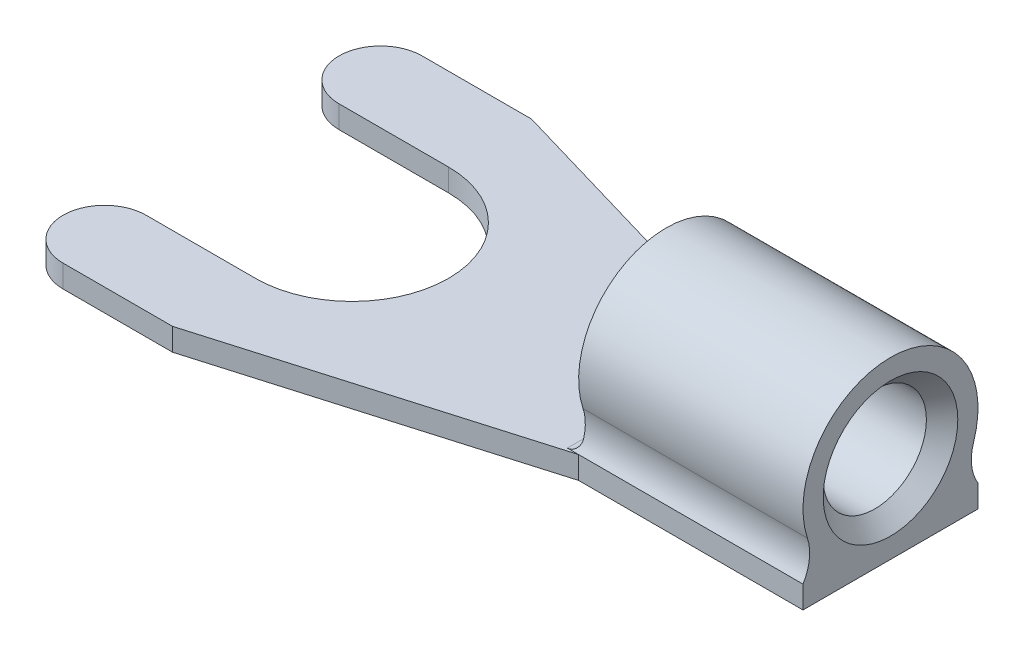
ISO-10303-21;
HEADER;
FILE_DESCRIPTION(('STEP AP214'),'2;1');
FILE_NAME('part.step','',(''),(''),'','','');
FILE_SCHEMA(('AUTOMOTIVE_DESIGN { 1 0 10303 214 1 1 1 1 }'));
ENDSEC;
DATA;
#1=APPLICATION_CONTEXT('core data for automotive mechanical design processes');
#2=APPLICATION_PROTOCOL_DEFINITION('international standard','automotive_design',2000,#1);
#3=PRODUCT_CONTEXT('',#1,'mechanical');
#4=PRODUCT('Part','Part','',(#3));
#5=PRODUCT_RELATED_PRODUCT_CATEGORY('part','',(#4));
#6=PRODUCT_DEFINITION_FORMATION('','',#4);
#7=PRODUCT_DEFINITION_CONTEXT('part definition',#1,'design');
#8=PRODUCT_DEFINITION('design','',#6,#7);
#9=PRODUCT_DEFINITION_SHAPE('','',#8);
#10=(LENGTH_UNIT() NAMED_UNIT(*) SI_UNIT(.MILLI.,.METRE.));
#11=(NAMED_UNIT(*) PLANE_ANGLE_UNIT() SI_UNIT($,.RADIAN.));
#12=(NAMED_UNIT(*) SI_UNIT($,.STERADIAN.) SOLID_ANGLE_UNIT());
#13=UNCERTAINTY_MEASURE_WITH_UNIT(LENGTH_MEASURE(1.E-05),#10,'distance_accuracy_value','');
#14=(GEOMETRIC_REPRESENTATION_CONTEXT(3) GLOBAL_UNCERTAINTY_ASSIGNED_CONTEXT((#13)) GLOBAL_UNIT_ASSIGNED_CONTEXT((#10,
#11,#12)) REPRESENTATION_CONTEXT('',''));
#15=CARTESIAN_POINT('',(0.,0.,0.));
#16=DIRECTION('',(0.,0.,1.));
#17=DIRECTION('',(1.,0.,0.));
#18=AXIS2_PLACEMENT_3D('',#15,#16,#17);
#19=CARTESIAN_POINT('',(6.75,0.75,0.));
#20=DIRECTION('',(0.,0.,-1.));
#21=DIRECTION('',(-1.,0.,0.));
#22=AXIS2_PLACEMENT_3D('',#19,#20,#21);
#23=CYLINDRICAL_SURFACE('',#22,0.25);
#24=DIRECTION('',(0.,0.,-1.));
#25=VECTOR('',#24,1.);
#26=CARTESIAN_POINT('',(7.,0.75,0.));
#27=LINE('',#26,#25);
#28=CARTESIAN_POINT('',(7.,0.75,1.83970172769144));
#29=VERTEX_POINT('',#28);
#30=CARTESIAN_POINT('',(7.,0.75,-1.83970172769145));
#31=VERTEX_POINT('',#30);
#32=EDGE_CURVE('E136',#29,#31,#27,.T.);
#33=ORIENTED_EDGE('',*,*,#32,.T.);
#34=CARTESIAN_POINT('',(6.75,0.5,-1.95));
#35=CARTESIAN_POINT('',(6.76279265219974,0.49998350208187,-1.95001852201698));
#36=CARTESIAN_POINT('',(6.7755633057261,0.500980599796446,-1.94939519772531));
#37=CARTESIAN_POINT('',(6.80063546863913,0.504859731445587,-1.94701727306771));
#38=CARTESIAN_POINT('',(6.81293922839229,0.507731040580708,-1.94526911017123));
#39=CARTESIAN_POINT('',(6.83678560324556,0.515212911902467,-1.94079455531296));
#40=CARTESIAN_POINT('',(6.84832945788207,0.519820554876355,-1.93806980561242));
#41=CARTESIAN_POINT('',(6.870457868658,0.530588402063698,-1.9318583154222));
#42=CARTESIAN_POINT('',(6.88104113706603,0.536750649720279,-1.92837057282786));
#43=CARTESIAN_POINT('',(6.90182686819083,0.550955109626043,-1.92057204094232));
#44=CARTESIAN_POINT('',(6.91194019338923,0.559104161345929,-1.91621898373589));
#45=CARTESIAN_POINT('',(6.93070840237227,0.576764076820902,-1.90714700315842));
#46=CARTESIAN_POINT('',(6.93936258007138,0.586275595783677,-1.90242790426221));
#47=CARTESIAN_POINT('',(6.95610042568564,0.607764133345738,-1.89223760604453));
#48=CARTESIAN_POINT('',(6.96396839551215,0.619900907889746,-1.88674760040437));
#49=CARTESIAN_POINT('',(6.97751486064914,0.645381102194384,-1.87588282433389));
#50=CARTESIAN_POINT('',(6.98319426201095,0.65872401979007,-1.87050800708861));
#51=CARTESIAN_POINT('',(6.99171759524682,0.684875563743601,-1.86066348131627));
#52=CARTESIAN_POINT('',(6.99479581212117,0.697594317014776,-1.85615788313342));
#53=CARTESIAN_POINT('',(6.99894022470101,0.723508733763793,-1.84757298169228));
#54=CARTESIAN_POINT('',(7.00000420944867,0.736704905121006,-1.84349415151592));
#55=CARTESIAN_POINT('',(7.,0.75,-1.83970172769145));
#56=B_SPLINE_CURVE_WITH_KNOTS('',3,(#34,#35,#36,#37,#38,#39,#40,#41,#42,#43,#44,#45,#46,#47,#48,
#49,#50,#51,#52,#53,#54,#55),.UNSPECIFIED.,.F.,.F.,(4,2,2,2,2,2,2,2,2,2,4),(0.,
0.0382893069018886,0.0763614093332972,0.114369786533511,0.152428386377301,0.193361552979276,
0.234314470757137,0.280522325949254,0.326711030823096,0.368073046255097,0.409480437175454),.UNSPECIFIED.);
#57=CARTESIAN_POINT('',(6.75,0.5,-1.95));
#58=VERTEX_POINT('',#57);
#59=EDGE_CURVE('E20',#58,#31,#56,.T.);
#60=ORIENTED_EDGE('',*,*,#59,.F.);
#61=DIRECTION('',(0.,0.,1.));
#62=VECTOR('',#61,1.);
#63=CARTESIAN_POINT('',(6.75,0.5,0.));
#64=LINE('',#63,#62);
#65=CARTESIAN_POINT('',(6.75,0.5,1.95));
#66=VERTEX_POINT('',#65);
#67=EDGE_CURVE('E133',#66,#58,#64,.F.);
#68=ORIENTED_EDGE('',*,*,#67,.F.);
#69=CARTESIAN_POINT('',(7.,0.75,1.83970172769144));
#70=CARTESIAN_POINT('',(7.000006521075,0.735127796790294,1.84394032011878));
#71=CARTESIAN_POINT('',(6.99867427441531,0.720382659943751,1.84854137054598));
#72=CARTESIAN_POINT('',(6.99350891013348,0.691550767285415,1.8582501300237));
#73=CARTESIAN_POINT('',(6.98968232860374,0.677462393603863,1.86335648540662));
#74=CARTESIAN_POINT('',(6.97970942661208,0.650283784135015,1.87387530595083));
#75=CARTESIAN_POINT('',(6.97356600432858,0.637192325778406,1.87928738151938));
#76=CARTESIAN_POINT('',(6.95913179602968,0.612263039792255,1.89017218669945));
#77=CARTESIAN_POINT('',(6.95083905655132,0.600426366468528,1.8956449671302));
#78=CARTESIAN_POINT('',(6.93190778527895,0.577851412965472,1.9065665800011));
#79=CARTESIAN_POINT('',(6.92118933448232,0.567175227082837,1.9120058737872));
#80=CARTESIAN_POINT('',(6.89781213081132,0.547807805392044,1.92224466813309));
#81=CARTESIAN_POINT('',(6.88515348283173,0.539116462338589,1.92704420325457));
#82=CARTESIAN_POINT('',(6.85882494158289,0.524449038300311,1.93536105133942));
#83=CARTESIAN_POINT('',(6.84523320827134,0.518362266308088,1.93892902019162));
#84=CARTESIAN_POINT('',(6.81693782547046,0.508667793434214,1.9446966990955));
#85=CARTESIAN_POINT('',(6.80223768054368,0.505052615028265,1.94690053424634));
#86=CARTESIAN_POINT('',(6.78112626789295,0.501866510936535,1.94885133002611));
#87=CARTESIAN_POINT('',(6.7749289859734,0.501167615441771,1.94928088909551));
#88=CARTESIAN_POINT('',(6.76248923138757,0.500234473310872,1.94985533198226));
#89=CARTESIAN_POINT('',(6.75624677974096,0.500000022951555,1.95000034061393));
#90=CARTESIAN_POINT('',(6.75,0.5,1.95));
#91=B_SPLINE_CURVE_WITH_KNOTS('',3,(#69,#70,#71,#72,#73,#74,#75,#76,#77,#78,#79,#80,#81,#82,#83,
#84,#85,#86,#87,#88,#89,#90),.UNSPECIFIED.,.F.,.F.,(4,2,2,2,2,2,2,2,2,2,4),(0.,
0.0462989373863092,0.0924770392758406,0.138597566715203,0.18476015989697,0.232751610935631,
0.280740468279867,0.326416072227268,0.371952870974995,0.390686940772955,0.409412791278968),.UNSPECIFIED.);
#92=EDGE_CURVE('E141',#29,#66,#91,.T.);
#93=ORIENTED_EDGE('',*,*,#92,.F.);
#94=EDGE_LOOP('',(#33,#60,#68,#93));
#95=FACE_BOUND('',#94,.T.);
#96=ADVANCED_FACE('F16',(#95),#23,.F.);
#97=CARTESIAN_POINT('',(7.,1.95,0.));
#98=DIRECTION('',(1.,0.,0.));
#99=DIRECTION('',(0.,0.,-1.));
#100=AXIS2_PLACEMENT_3D('',#97,#98,#99);
#101=CYLINDRICAL_SURFACE('',#100,1.15);
#102=CARTESIAN_POINT('',(11.6499999999746,1.95,0.));
#103=DIRECTION('',(1.,0.,0.));
#104=DIRECTION('',(0.,0.,-1.));
#105=AXIS2_PLACEMENT_3D('',#102,#103,#104);
#106=CIRCLE('',#105,1.14999999999554);
#107=CARTESIAN_POINT('',(11.6499999999746,1.95,-1.14999999999554));
#108=VERTEX_POINT('',#107);
#109=EDGE_CURVE('E225',#108,#108,#106,.T.);
#110=ORIENTED_EDGE('',*,*,#109,.T.);
#111=EDGE_LOOP('',(#110));
#112=FACE_BOUND('',#111,.T.);
#113=CARTESIAN_POINT('',(7.,1.95,0.));
#114=DIRECTION('',(1.,0.,0.));
#115=DIRECTION('',(0.,0.,-1.));
#116=AXIS2_PLACEMENT_3D('',#113,#114,#115);
#117=CIRCLE('',#116,1.15);
#118=CARTESIAN_POINT('',(7.,1.95,-1.15));
#119=VERTEX_POINT('',#118);
#120=EDGE_CURVE('E151',#119,#119,#117,.F.);
#121=ORIENTED_EDGE('',*,*,#120,.T.);
#122=EDGE_LOOP('',(#121));
#123=FACE_BOUND('',#122,.T.);
#124=ADVANCED_FACE('F279',(#112,#123),#101,.F.);
#125=CARTESIAN_POINT('',(7.,1.95,0.));
#126=DIRECTION('',(1.,0.,0.));
#127=DIRECTION('',(0.,0.,-1.));
#128=AXIS2_PLACEMENT_3D('',#125,#126,#127);
#129=PLANE('',#128);
#130=ORIENTED_EDGE('',*,*,#120,.F.);
#131=EDGE_LOOP('',(#130));
#132=FACE_BOUND('',#131,.T.);
#133=ORIENTED_EDGE('',*,*,#32,.F.);
#134=CARTESIAN_POINT('',(7.,1.02486780796408,2.80118375463996));
#135=DIRECTION('',(-1.,0.,0.));
#136=DIRECTION('',(0.,0.,1.));
#137=AXIS2_PLACEMENT_3D('',#134,#135,#136);
#138=CIRCLE('',#137,1.);
#139=CARTESIAN_POINT('',(7.,1.33847194085761,1.85162993950777));
#140=VERTEX_POINT('',#139);
#141=EDGE_CURVE('E192',#29,#140,#138,.F.);
#142=ORIENTED_EDGE('',*,*,#141,.T.);
#143=CARTESIAN_POINT('',(7.,1.95,0.));
#144=DIRECTION('',(1.,0.,0.));
#145=DIRECTION('',(0.,0.,-1.));
#146=AXIS2_PLACEMENT_3D('',#143,#144,#145);
#147=CIRCLE('',#146,1.95);
#148=CARTESIAN_POINT('',(7.,1.33847194085761,-1.85162993950777));
#149=VERTEX_POINT('',#148);
#150=EDGE_CURVE('E162',#149,#140,#147,.T.);
#151=ORIENTED_EDGE('',*,*,#150,.F.);
#152=CARTESIAN_POINT('',(7.,1.02486780796408,-2.80118375463996));
#153=DIRECTION('',(1.,0.,0.));
#154=DIRECTION('',(0.,0.,-1.));
#155=AXIS2_PLACEMENT_3D('',#152,#153,#154);
#156=CIRCLE('',#155,1.);
#157=EDGE_CURVE('E224',#31,#149,#156,.F.);
#158=ORIENTED_EDGE('',*,*,#157,.F.);
#159=EDGE_LOOP('',(#133,#142,#151,#158));
#160=FACE_BOUND('',#159,.T.);
#161=ADVANCED_FACE('F277',(#132,#160),#129,.F.);
#162=CARTESIAN_POINT('',(0.,0.5,0.));
#163=DIRECTION('',(0.,1.,0.));
#164=DIRECTION('',(0.,0.,1.));
#165=AXIS2_PLACEMENT_3D('',#162,#163,#164);
#166=PLANE('',#165);
#167=DIRECTION('',(-0.959692321040619,0.,0.281052751161895));
#168=VECTOR('',#167,1.);
#169=CARTESIAN_POINT('',(1.07889666838964,0.5,3.68403740425732));
#170=LINE('',#169,#168);
#171=CARTESIAN_POINT('',(0.,0.5,4.));
#172=VERTEX_POINT('',#171);
#173=CARTESIAN_POINT('',(7.,0.5,1.95));
#174=VERTEX_POINT('',#173);
#175=EDGE_CURVE('E198',#172,#174,#170,.F.);
#176=ORIENTED_EDGE('',*,*,#175,.T.);
#177=DIRECTION('',(-1.,0.,0.));
#178=VECTOR('',#177,1.);
#179=CARTESIAN_POINT('',(0.,0.499999999999999,1.95));
#180=LINE('',#179,#178);
#181=EDGE_CURVE('E149',#174,#66,#180,.T.);
#182=ORIENTED_EDGE('',*,*,#181,.T.);
#183=ORIENTED_EDGE('',*,*,#67,.T.);
#184=DIRECTION('',(1.,0.,0.));
#185=VECTOR('',#184,1.);
#186=CARTESIAN_POINT('',(0.,0.5,-1.95));
#187=LINE('',#186,#185);
#188=CARTESIAN_POINT('',(7.,0.5,-1.95));
#189=VERTEX_POINT('',#188);
#190=EDGE_CURVE('E147',#58,#189,#187,.T.);
#191=ORIENTED_EDGE('',*,*,#190,.T.);
#192=DIRECTION('',(0.959692321040619,0.,0.281052751161895));
#193=VECTOR('',#192,1.);
#194=CARTESIAN_POINT('',(1.07889666838964,0.5,-3.68403740425732));
#195=LINE('',#194,#193);
#196=CARTESIAN_POINT('',(0.,0.5,-4.));
#197=VERTEX_POINT('',#196);
#198=EDGE_CURVE('E156',#189,#197,#195,.F.);
#199=ORIENTED_EDGE('',*,*,#198,.T.);
#200=DIRECTION('',(-1.,0.,0.));
#201=VECTOR('',#200,1.);
#202=CARTESIAN_POINT('',(0.,0.5,-4.));
#203=LINE('',#202,#201);
#204=CARTESIAN_POINT('',(-2.43926218353009,0.5,-4.));
#205=VERTEX_POINT('',#204);
#206=EDGE_CURVE('E159',#205,#197,#203,.F.);
#207=ORIENTED_EDGE('',*,*,#206,.F.);
#208=CARTESIAN_POINT('',(-2.43926218353009,0.5,-3.075));
#209=DIRECTION('',(0.,-1.,0.));
#210=DIRECTION('',(0.,0.,-1.));
#211=AXIS2_PLACEMENT_3D('',#208,#209,#210);
#212=CIRCLE('',#211,0.925);
#213=CARTESIAN_POINT('',(-2.43926218353009,0.5,-2.15));
#214=VERTEX_POINT('',#213);
#215=EDGE_CURVE('E254',#214,#205,#212,.T.);
#216=ORIENTED_EDGE('',*,*,#215,.F.);
#217=DIRECTION('',(1.,0.,0.));
#218=VECTOR('',#217,1.);
#219=CARTESIAN_POINT('',(0.,0.5,-2.15));
#220=LINE('',#219,#218);
#221=CARTESIAN_POINT('',(0.,0.5,-2.15));
#222=VERTEX_POINT('',#221);
#223=EDGE_CURVE('E215',#222,#214,#220,.F.);
#224=ORIENTED_EDGE('',*,*,#223,.F.);
#225=CARTESIAN_POINT('',(0.,0.5,0.));
#226=DIRECTION('',(0.,-1.,0.));
#227=DIRECTION('',(0.,0.,-1.));
#228=AXIS2_PLACEMENT_3D('',#225,#226,#227);
#229=CIRCLE('',#228,2.15);
#230=CARTESIAN_POINT('',(0.,0.5,2.15));
#231=VERTEX_POINT('',#230);
#232=EDGE_CURVE('E251',#222,#231,#229,.T.);
#233=ORIENTED_EDGE('',*,*,#232,.T.);
#234=DIRECTION('',(1.,0.,0.));
#235=VECTOR('',#234,1.);
#236=CARTESIAN_POINT('',(0.,0.5,2.15));
#237=LINE('',#236,#235);
#238=CARTESIAN_POINT('',(-2.43926218353009,0.5,2.15));
#239=VERTEX_POINT('',#238);
#240=EDGE_CURVE('E210',#231,#239,#237,.F.);
#241=ORIENTED_EDGE('',*,*,#240,.T.);
#242=CARTESIAN_POINT('',(-2.43926218353009,0.5,3.075));
#243=DIRECTION('',(0.,-1.,0.));
#244=DIRECTION('',(0.,0.,-1.));
#245=AXIS2_PLACEMENT_3D('',#242,#243,#244);
#246=CIRCLE('',#245,0.925);
#247=CARTESIAN_POINT('',(-2.43926218353009,0.5,4.));
#248=VERTEX_POINT('',#247);
#249=EDGE_CURVE('E213',#248,#239,#246,.T.);
#250=ORIENTED_EDGE('',*,*,#249,.F.);
#251=DIRECTION('',(-1.,0.,0.));
#252=VECTOR('',#251,1.);
#253=CARTESIAN_POINT('',(0.,0.5,4.));
#254=LINE('',#253,#252);
#255=EDGE_CURVE('E205',#248,#172,#254,.F.);
#256=ORIENTED_EDGE('',*,*,#255,.T.);
#257=EDGE_LOOP('',(#176,#182,#183,#191,#199,#207,#216,#224,#233,#241,#250,#256));
#258=FACE_BOUND('',#257,.T.);
#259=ADVANCED_FACE('F145',(#258),#166,.T.);
#260=CARTESIAN_POINT('',(0.,1.02486780796408,2.80118375463996));
#261=DIRECTION('',(-1.,0.,0.));
#262=DIRECTION('',(0.,0.,1.));
#263=AXIS2_PLACEMENT_3D('',#260,#261,#262);
#264=CYLINDRICAL_SURFACE('',#263,1.);
#265=ORIENTED_EDGE('',*,*,#92,.T.);
#266=ORIENTED_EDGE('',*,*,#181,.F.);
#267=DIRECTION('',(-1.,0.,0.));
#268=VECTOR('',#267,1.);
#269=CARTESIAN_POINT('',(0.,0.5,1.95));
#270=LINE('',#269,#268);
#271=CARTESIAN_POINT('',(12.,0.499999999999997,1.95));
#272=VERTEX_POINT('',#271);
#273=EDGE_CURVE('E179',#174,#272,#270,.F.);
#274=ORIENTED_EDGE('',*,*,#273,.T.);
#275=CARTESIAN_POINT('',(12.,1.02486780796408,2.80118375463996));
#276=DIRECTION('',(-1.,0.,0.));
#277=DIRECTION('',(0.,0.,1.));
#278=AXIS2_PLACEMENT_3D('',#275,#276,#277);
#279=CIRCLE('',#278,1.);
#280=CARTESIAN_POINT('',(12.,1.33847194085761,1.85162993950777));
#281=VERTEX_POINT('',#280);
#282=EDGE_CURVE('E193',#281,#272,#279,.T.);
#283=ORIENTED_EDGE('',*,*,#282,.F.);
#284=DIRECTION('',(-1.,0.,0.));
#285=VECTOR('',#284,1.);
#286=CARTESIAN_POINT('',(0.,1.33847194085761,1.85162993950777));
#287=LINE('',#286,#285);
#288=EDGE_CURVE('E150',#140,#281,#287,.F.);
#289=ORIENTED_EDGE('',*,*,#288,.F.);
#290=ORIENTED_EDGE('',*,*,#141,.F.);
#291=EDGE_LOOP('',(#265,#266,#274,#283,#289,#290));
#292=FACE_BOUND('',#291,.T.);
#293=ADVANCED_FACE('F267',(#292),#264,.F.);
#294=CARTESIAN_POINT('',(11.9999999999436,1.95,0.));
#295=DIRECTION('',(1.,0.,0.));
#296=DIRECTION('',(0.,0.,-1.));
#297=AXIS2_PLACEMENT_3D('',#294,#295,#296);
#298=CONICAL_SURFACE('',#297,1.49999999996453,0.785398163397448);
#299=CARTESIAN_POINT('',(12.0000000000005,1.95,0.));
#300=DIRECTION('',(1.,0.,0.));
#301=DIRECTION('',(0.,0.,-1.));
#302=AXIS2_PLACEMENT_3D('',#299,#300,#301);
#303=CIRCLE('',#302,1.50000000002137);
#304=CARTESIAN_POINT('',(12.0000000000005,1.95,-1.50000000002137));
#305=VERTEX_POINT('',#304);
#306=EDGE_CURVE('E182',#305,#305,#303,.T.);
#307=ORIENTED_EDGE('',*,*,#306,.T.);
#308=EDGE_LOOP('',(#307));
#309=FACE_BOUND('',#308,.T.);
#310=ORIENTED_EDGE('',*,*,#109,.F.);
#311=EDGE_LOOP('',(#310));
#312=FACE_BOUND('',#311,.T.);
#313=ADVANCED_FACE('F272',(#309,#312),#298,.F.);
#314=CARTESIAN_POINT('',(7.,1.95,0.));
#315=DIRECTION('',(1.,0.,0.));
#316=DIRECTION('',(0.,0.,-1.));
#317=AXIS2_PLACEMENT_3D('',#314,#315,#316);
#318=CYLINDRICAL_SURFACE('',#317,1.95);
#319=CARTESIAN_POINT('',(12.,1.95,0.));
#320=DIRECTION('',(1.,0.,0.));
#321=DIRECTION('',(0.,0.,-1.));
#322=AXIS2_PLACEMENT_3D('',#319,#320,#321);
#323=CIRCLE('',#322,1.95);
#324=CARTESIAN_POINT('',(12.,1.33847194085761,-1.85162993950777));
#325=VERTEX_POINT('',#324);
#326=EDGE_CURVE('E244',#281,#325,#323,.F.);
#327=ORIENTED_EDGE('',*,*,#326,.T.);
#328=DIRECTION('',(1.,0.,0.));
#329=VECTOR('',#328,1.);
#330=CARTESIAN_POINT('',(0.,1.33847194085761,-1.85162993950777));
#331=LINE('',#330,#329);
#332=EDGE_CURVE('E157',#325,#149,#331,.F.);
#333=ORIENTED_EDGE('',*,*,#332,.T.);
#334=ORIENTED_EDGE('',*,*,#150,.T.);
#335=ORIENTED_EDGE('',*,*,#288,.T.);
#336=EDGE_LOOP('',(#327,#333,#334,#335));
#337=FACE_BOUND('',#336,.T.);
#338=ADVANCED_FACE('F344',(#337),#318,.T.);
#339=CARTESIAN_POINT('',(0.,1.02486780796408,-2.80118375463996));
#340=DIRECTION('',(1.,0.,0.));
#341=DIRECTION('',(0.,0.,-1.));
#342=AXIS2_PLACEMENT_3D('',#339,#340,#341);
#343=CYLINDRICAL_SURFACE('',#342,1.);
#344=DIRECTION('',(1.,0.,0.));
#345=VECTOR('',#344,1.);
#346=CARTESIAN_POINT('',(0.,0.5,-1.95));
#347=LINE('',#346,#345);
#348=CARTESIAN_POINT('',(12.,0.499999999999999,-1.95));
#349=VERTEX_POINT('',#348);
#350=EDGE_CURVE('E155',#349,#189,#347,.F.);
#351=ORIENTED_EDGE('',*,*,#350,.T.);
#352=ORIENTED_EDGE('',*,*,#190,.F.);
#353=ORIENTED_EDGE('',*,*,#59,.T.);
#354=ORIENTED_EDGE('',*,*,#157,.T.);
#355=ORIENTED_EDGE('',*,*,#332,.F.);
#356=CARTESIAN_POINT('',(12.,1.02486780796408,-2.80118375463996));
#357=DIRECTION('',(1.,0.,0.));
#358=DIRECTION('',(0.,0.,-1.));
#359=AXIS2_PLACEMENT_3D('',#356,#357,#358);
#360=CIRCLE('',#359,1.);
#361=EDGE_CURVE('E171',#325,#349,#360,.T.);
#362=ORIENTED_EDGE('',*,*,#361,.T.);
#363=EDGE_LOOP('',(#351,#352,#353,#354,#355,#362));
#364=FACE_BOUND('',#363,.T.);
#365=ADVANCED_FACE('F154',(#364),#343,.F.);
#366=CARTESIAN_POINT('',(1.07889666838964,0.5,-3.68403740425732));
#367=DIRECTION('',(-0.281052751161895,0.,0.959692321040619));
#368=DIRECTION('',(0.959692321040619,0.,0.281052751161895));
#369=AXIS2_PLACEMENT_3D('',#366,#367,#368);
#370=PLANE('',#369);
#371=DIRECTION('',(0.,1.,0.));
#372=VECTOR('',#371,1.);
#373=CARTESIAN_POINT('',(0.,0.5,-4.));
#374=LINE('',#373,#372);
#375=CARTESIAN_POINT('',(0.,0.,-4.));
#376=VERTEX_POINT('',#375);
#377=EDGE_CURVE('E220',#197,#376,#374,.F.);
#378=ORIENTED_EDGE('',*,*,#377,.F.);
#379=ORIENTED_EDGE('',*,*,#198,.F.);
#380=DIRECTION('',(0.,1.,0.));
#381=VECTOR('',#380,1.);
#382=CARTESIAN_POINT('',(7.,0.5,-1.95));
#383=LINE('',#382,#381);
#384=CARTESIAN_POINT('',(7.,0.,-1.95));
#385=VERTEX_POINT('',#384);
#386=EDGE_CURVE('E389',#189,#385,#383,.F.);
#387=ORIENTED_EDGE('',*,*,#386,.T.);
#388=DIRECTION('',(-0.959692321040619,0.,-0.281052751161895));
#389=VECTOR('',#388,1.);
#390=CARTESIAN_POINT('',(7.,0.,-1.95));
#391=LINE('',#390,#389);
#392=EDGE_CURVE('E386',#385,#376,#391,.T.);
#393=ORIENTED_EDGE('',*,*,#392,.T.);
#394=EDGE_LOOP('',(#378,#379,#387,#393));
#395=FACE_BOUND('',#394,.T.);
#396=ADVANCED_FACE('F338',(#395),#370,.F.);
#397=CARTESIAN_POINT('',(0.,0.5,-4.));
#398=DIRECTION('',(0.,0.,-1.));
#399=DIRECTION('',(-1.,0.,0.));
#400=AXIS2_PLACEMENT_3D('',#397,#398,#399);
#401=PLANE('',#400);
#402=ORIENTED_EDGE('',*,*,#206,.T.);
#403=ORIENTED_EDGE('',*,*,#377,.T.);
#404=DIRECTION('',(1.,0.,0.));
#405=VECTOR('',#404,1.);
#406=CARTESIAN_POINT('',(0.,0.,-4.));
#407=LINE('',#406,#405);
#408=CARTESIAN_POINT('',(-2.43926218353009,0.,-4.));
#409=VERTEX_POINT('',#408);
#410=EDGE_CURVE('E242',#376,#409,#407,.F.);
#411=ORIENTED_EDGE('',*,*,#410,.T.);
#412=DIRECTION('',(0.,-1.,0.));
#413=VECTOR('',#412,1.);
#414=CARTESIAN_POINT('',(-2.43926218353009,0.5,-4.));
#415=LINE('',#414,#413);
#416=EDGE_CURVE('E218',#205,#409,#415,.T.);
#417=ORIENTED_EDGE('',*,*,#416,.F.);
#418=EDGE_LOOP('',(#402,#403,#411,#417));
#419=FACE_BOUND('',#418,.T.);
#420=ADVANCED_FACE('F334',(#419),#401,.T.);
#421=CARTESIAN_POINT('',(-2.43926218353009,0.5,-3.075));
#422=DIRECTION('',(0.,-1.,0.));
#423=DIRECTION('',(0.,0.,-1.));
#424=AXIS2_PLACEMENT_3D('',#421,#422,#423);
#425=CYLINDRICAL_SURFACE('',#424,0.925);
#426=ORIENTED_EDGE('',*,*,#215,.T.);
#427=ORIENTED_EDGE('',*,*,#416,.T.);
#428=CARTESIAN_POINT('',(-2.43926218353009,0.,-3.075));
#429=DIRECTION('',(0.,-1.,0.));
#430=DIRECTION('',(0.,0.,-1.));
#431=AXIS2_PLACEMENT_3D('',#428,#429,#430);
#432=CIRCLE('',#431,0.925);
#433=CARTESIAN_POINT('',(-2.43926218353009,0.,-2.15));
#434=VERTEX_POINT('',#433);
#435=EDGE_CURVE('E239',#409,#434,#432,.F.);
#436=ORIENTED_EDGE('',*,*,#435,.T.);
#437=DIRECTION('',(0.,1.,0.));
#438=VECTOR('',#437,1.);
#439=CARTESIAN_POINT('',(-2.43926218353009,0.5,-2.15));
#440=LINE('',#439,#438);
#441=EDGE_CURVE('E217',#214,#434,#440,.F.);
#442=ORIENTED_EDGE('',*,*,#441,.F.);
#443=EDGE_LOOP('',(#426,#427,#436,#442));
#444=FACE_BOUND('',#443,.T.);
#445=ADVANCED_FACE('F330',(#444),#425,.T.);
#446=CARTESIAN_POINT('',(0.,0.5,-2.15));
#447=DIRECTION('',(0.,0.,1.));
#448=DIRECTION('',(1.,0.,0.));
#449=AXIS2_PLACEMENT_3D('',#446,#447,#448);
#450=PLANE('',#449);
#451=ORIENTED_EDGE('',*,*,#223,.T.);
#452=ORIENTED_EDGE('',*,*,#441,.T.);
#453=DIRECTION('',(1.,0.,0.));
#454=VECTOR('',#453,1.);
#455=CARTESIAN_POINT('',(0.,0.,-2.15));
#456=LINE('',#455,#454);
#457=CARTESIAN_POINT('',(0.,0.,-2.15));
#458=VERTEX_POINT('',#457);
#459=EDGE_CURVE('E238',#434,#458,#456,.T.);
#460=ORIENTED_EDGE('',*,*,#459,.T.);
#461=DIRECTION('',(0.,-1.,0.));
#462=VECTOR('',#461,1.);
#463=CARTESIAN_POINT('',(0.,0.5,-2.15));
#464=LINE('',#463,#462);
#465=EDGE_CURVE('E253',#458,#222,#464,.F.);
#466=ORIENTED_EDGE('',*,*,#465,.T.);
#467=EDGE_LOOP('',(#451,#452,#460,#466));
#468=FACE_BOUND('',#467,.T.);
#469=ADVANCED_FACE('F326',(#468),#450,.T.);
#470=CARTESIAN_POINT('',(0.,0.5,0.));
#471=DIRECTION('',(0.,-1.,0.));
#472=DIRECTION('',(0.,0.,-1.));
#473=AXIS2_PLACEMENT_3D('',#470,#471,#472);
#474=CYLINDRICAL_SURFACE('',#473,2.15);
#475=DIRECTION('',(0.,1.,0.));
#476=VECTOR('',#475,1.);
#477=CARTESIAN_POINT('',(0.,0.5,2.15));
#478=LINE('',#477,#476);
#479=CARTESIAN_POINT('',(0.,0.,2.15));
#480=VERTEX_POINT('',#479);
#481=EDGE_CURVE('E214',#480,#231,#478,.T.);
#482=ORIENTED_EDGE('',*,*,#481,.T.);
#483=ORIENTED_EDGE('',*,*,#232,.F.);
#484=ORIENTED_EDGE('',*,*,#465,.F.);
#485=CARTESIAN_POINT('',(0.,0.,0.));
#486=DIRECTION('',(0.,-1.,0.));
#487=DIRECTION('',(0.,0.,-1.));
#488=AXIS2_PLACEMENT_3D('',#485,#486,#487);
#489=CIRCLE('',#488,2.15);
#490=EDGE_CURVE('E235',#458,#480,#489,.T.);
#491=ORIENTED_EDGE('',*,*,#490,.T.);
#492=EDGE_LOOP('',(#482,#483,#484,#491));
#493=FACE_BOUND('',#492,.T.);
#494=ADVANCED_FACE('F322',(#493),#474,.F.);
#495=CARTESIAN_POINT('',(0.,0.5,2.15));
#496=DIRECTION('',(0.,0.,1.));
#497=DIRECTION('',(1.,0.,0.));
#498=AXIS2_PLACEMENT_3D('',#495,#496,#497);
#499=PLANE('',#498);
#500=DIRECTION('',(0.,-1.,0.));
#501=VECTOR('',#500,1.);
#502=CARTESIAN_POINT('',(-2.43926218353009,0.5,2.15));
#503=LINE('',#502,#501);
#504=CARTESIAN_POINT('',(-2.43926218353009,0.,2.15));
#505=VERTEX_POINT('',#504);
#506=EDGE_CURVE('E250',#239,#505,#503,.T.);
#507=ORIENTED_EDGE('',*,*,#506,.F.);
#508=ORIENTED_EDGE('',*,*,#240,.F.);
#509=ORIENTED_EDGE('',*,*,#481,.F.);
#510=DIRECTION('',(1.,0.,0.));
#511=VECTOR('',#510,1.);
#512=CARTESIAN_POINT('',(0.,0.,2.15));
#513=LINE('',#512,#511);
#514=EDGE_CURVE('E234',#480,#505,#513,.F.);
#515=ORIENTED_EDGE('',*,*,#514,.T.);
#516=EDGE_LOOP('',(#507,#508,#509,#515));
#517=FACE_BOUND('',#516,.T.);
#518=ADVANCED_FACE('F318',(#517),#499,.F.);
#519=CARTESIAN_POINT('',(-2.43926218353009,0.5,3.075));
#520=DIRECTION('',(0.,-1.,0.));
#521=DIRECTION('',(0.,0.,-1.));
#522=AXIS2_PLACEMENT_3D('',#519,#520,#521);
#523=CYLINDRICAL_SURFACE('',#522,0.925);
#524=ORIENTED_EDGE('',*,*,#249,.T.);
#525=ORIENTED_EDGE('',*,*,#506,.T.);
#526=CARTESIAN_POINT('',(-2.43926218353009,0.,3.075));
#527=DIRECTION('',(0.,-1.,0.));
#528=DIRECTION('',(0.,0.,-1.));
#529=AXIS2_PLACEMENT_3D('',#526,#527,#528);
#530=CIRCLE('',#529,0.925);
#531=CARTESIAN_POINT('',(-2.43926218353009,0.,4.));
#532=VERTEX_POINT('',#531);
#533=EDGE_CURVE('E230',#505,#532,#530,.F.);
#534=ORIENTED_EDGE('',*,*,#533,.T.);
#535=DIRECTION('',(0.,1.,0.));
#536=VECTOR('',#535,1.);
#537=CARTESIAN_POINT('',(-2.43926218353009,0.5,4.));
#538=LINE('',#537,#536);
#539=EDGE_CURVE('E207',#532,#248,#538,.T.);
#540=ORIENTED_EDGE('',*,*,#539,.T.);
#541=EDGE_LOOP('',(#524,#525,#534,#540));
#542=FACE_BOUND('',#541,.T.);
#543=ADVANCED_FACE('F314',(#542),#523,.T.);
#544=CARTESIAN_POINT('',(0.,0.5,4.));
#545=DIRECTION('',(0.,0.,-1.));
#546=DIRECTION('',(-1.,0.,0.));
#547=AXIS2_PLACEMENT_3D('',#544,#545,#546);
#548=PLANE('',#547);
#549=DIRECTION('',(0.,1.,0.));
#550=VECTOR('',#549,1.);
#551=CARTESIAN_POINT('',(0.,0.5,4.));
#552=LINE('',#551,#550);
#553=CARTESIAN_POINT('',(0.,0.,4.));
#554=VERTEX_POINT('',#553);
#555=EDGE_CURVE('E202',#554,#172,#552,.T.);
#556=ORIENTED_EDGE('',*,*,#555,.T.);
#557=ORIENTED_EDGE('',*,*,#255,.F.);
#558=ORIENTED_EDGE('',*,*,#539,.F.);
#559=DIRECTION('',(1.,0.,0.));
#560=VECTOR('',#559,1.);
#561=CARTESIAN_POINT('',(0.,0.,4.));
#562=LINE('',#561,#560);
#563=EDGE_CURVE('E233',#532,#554,#562,.T.);
#564=ORIENTED_EDGE('',*,*,#563,.T.);
#565=EDGE_LOOP('',(#556,#557,#558,#564));
#566=FACE_BOUND('',#565,.T.);
#567=ADVANCED_FACE('F310',(#566),#548,.F.);
#568=CARTESIAN_POINT('',(1.07889666838964,0.5,3.68403740425732));
#569=DIRECTION('',(-0.281052751161895,0.,-0.959692321040619));
#570=DIRECTION('',(-0.959692321040619,0.,0.281052751161895));
#571=AXIS2_PLACEMENT_3D('',#568,#569,#570);
#572=PLANE('',#571);
#573=DIRECTION('',(0.,1.,0.));
#574=VECTOR('',#573,1.);
#575=CARTESIAN_POINT('',(7.,0.5,1.95));
#576=LINE('',#575,#574);
#577=CARTESIAN_POINT('',(7.,0.,1.95));
#578=VERTEX_POINT('',#577);
#579=EDGE_CURVE('E183',#578,#174,#576,.T.);
#580=ORIENTED_EDGE('',*,*,#579,.T.);
#581=ORIENTED_EDGE('',*,*,#175,.F.);
#582=ORIENTED_EDGE('',*,*,#555,.F.);
#583=DIRECTION('',(0.959692321040619,0.,-0.281052751161895));
#584=VECTOR('',#583,1.);
#585=CARTESIAN_POINT('',(0.,0.,4.));
#586=LINE('',#585,#584);
#587=EDGE_CURVE('E188',#554,#578,#586,.T.);
#588=ORIENTED_EDGE('',*,*,#587,.T.);
#589=EDGE_LOOP('',(#580,#581,#582,#588));
#590=FACE_BOUND('',#589,.T.);
#591=ADVANCED_FACE('F306',(#590),#572,.F.);
#592=CARTESIAN_POINT('',(0.,0.5,1.95));
#593=DIRECTION('',(0.,0.,-1.));
#594=DIRECTION('',(-1.,0.,0.));
#595=AXIS2_PLACEMENT_3D('',#592,#593,#594);
#596=PLANE('',#595);
#597=DIRECTION('',(0.,1.,0.));
#598=VECTOR('',#597,1.);
#599=CARTESIAN_POINT('',(12.,0.5,1.95));
#600=LINE('',#599,#598);
#601=CARTESIAN_POINT('',(12.,0.,1.95));
#602=VERTEX_POINT('',#601);
#603=EDGE_CURVE('E246',#602,#272,#600,.T.);
#604=ORIENTED_EDGE('',*,*,#603,.T.);
#605=ORIENTED_EDGE('',*,*,#273,.F.);
#606=ORIENTED_EDGE('',*,*,#579,.F.);
#607=DIRECTION('',(1.,0.,0.));
#608=VECTOR('',#607,1.);
#609=CARTESIAN_POINT('',(0.,0.,1.95));
#610=LINE('',#609,#608);
#611=EDGE_CURVE('E176',#578,#602,#610,.T.);
#612=ORIENTED_EDGE('',*,*,#611,.T.);
#613=EDGE_LOOP('',(#604,#605,#606,#612));
#614=FACE_BOUND('',#613,.T.);
#615=ADVANCED_FACE('F302',(#614),#596,.F.);
#616=CARTESIAN_POINT('',(12.,0.5,0.));
#617=DIRECTION('',(-1.,0.,0.));
#618=DIRECTION('',(0.,0.,1.));
#619=AXIS2_PLACEMENT_3D('',#616,#617,#618);
#620=PLANE('',#619);
#621=DIRECTION('',(0.,1.,0.));
#622=VECTOR('',#621,1.);
#623=CARTESIAN_POINT('',(12.,0.5,-1.95));
#624=LINE('',#623,#622);
#625=CARTESIAN_POINT('',(12.,0.,-1.95));
#626=VERTEX_POINT('',#625);
#627=EDGE_CURVE('E39',#626,#349,#624,.T.);
#628=ORIENTED_EDGE('',*,*,#627,.T.);
#629=ORIENTED_EDGE('',*,*,#361,.F.);
#630=ORIENTED_EDGE('',*,*,#326,.F.);
#631=ORIENTED_EDGE('',*,*,#282,.T.);
#632=ORIENTED_EDGE('',*,*,#603,.F.);
#633=DIRECTION('',(0.,0.,1.));
#634=VECTOR('',#633,1.);
#635=CARTESIAN_POINT('',(12.,0.,0.));
#636=LINE('',#635,#634);
#637=EDGE_CURVE('E31',#602,#626,#636,.F.);
#638=ORIENTED_EDGE('',*,*,#637,.T.);
#639=EDGE_LOOP('',(#628,#629,#630,#631,#632,#638));
#640=FACE_BOUND('',#639,.T.);
#641=ORIENTED_EDGE('',*,*,#306,.F.);
#642=EDGE_LOOP('',(#641));
#643=FACE_BOUND('',#642,.T.);
#644=ADVANCED_FACE('F296',(#640,#643),#620,.F.);
#645=CARTESIAN_POINT('',(0.,0.5,-1.95));
#646=DIRECTION('',(0.,0.,1.));
#647=DIRECTION('',(1.,0.,0.));
#648=AXIS2_PLACEMENT_3D('',#645,#646,#647);
#649=PLANE('',#648);
#650=ORIENTED_EDGE('',*,*,#386,.F.);
#651=ORIENTED_EDGE('',*,*,#350,.F.);
#652=ORIENTED_EDGE('',*,*,#627,.F.);
#653=DIRECTION('',(1.,0.,0.));
#654=VECTOR('',#653,1.);
#655=CARTESIAN_POINT('',(0.,0.,-1.95));
#656=LINE('',#655,#654);
#657=EDGE_CURVE('E11',#626,#385,#656,.F.);
#658=ORIENTED_EDGE('',*,*,#657,.T.);
#659=EDGE_LOOP('',(#650,#651,#652,#658));
#660=FACE_BOUND('',#659,.T.);
#661=ADVANCED_FACE('F290',(#660),#649,.F.);
#662=CARTESIAN_POINT('',(0.,0.,0.));
#663=DIRECTION('',(0.,1.,0.));
#664=DIRECTION('',(0.,0.,1.));
#665=AXIS2_PLACEMENT_3D('',#662,#663,#664);
#666=PLANE('',#665);
#667=ORIENTED_EDGE('',*,*,#637,.F.);
#668=ORIENTED_EDGE('',*,*,#611,.F.);
#669=ORIENTED_EDGE('',*,*,#587,.F.);
#670=ORIENTED_EDGE('',*,*,#563,.F.);
#671=ORIENTED_EDGE('',*,*,#533,.F.);
#672=ORIENTED_EDGE('',*,*,#514,.F.);
#673=ORIENTED_EDGE('',*,*,#490,.F.);
#674=ORIENTED_EDGE('',*,*,#459,.F.);
#675=ORIENTED_EDGE('',*,*,#435,.F.);
#676=ORIENTED_EDGE('',*,*,#410,.F.);
#677=ORIENTED_EDGE('',*,*,#392,.F.);
#678=ORIENTED_EDGE('',*,*,#657,.F.);
#679=EDGE_LOOP('',(#667,#668,#669,#670,#671,#672,#673,#674,#675,#676,#677,#678));
#680=FACE_BOUND('',#679,.T.);
#681=ADVANCED_FACE('F288',(#680),#666,.F.);
#682=CLOSED_SHELL('',(#96,#124,#161,#259,#293,#313,#338,#365,#396,#420,#445,#469,#494,#518,#543,
#567,#591,#615,#644,#661,#681));
#683=MANIFOLD_SOLID_BREP('B1',#682);
#684=ADVANCED_BREP_SHAPE_REPRESENTATION('',(#18,#683),#14);
#685=SHAPE_DEFINITION_REPRESENTATION(#9,#684);
ENDSEC;
END-ISO-10303-21;
